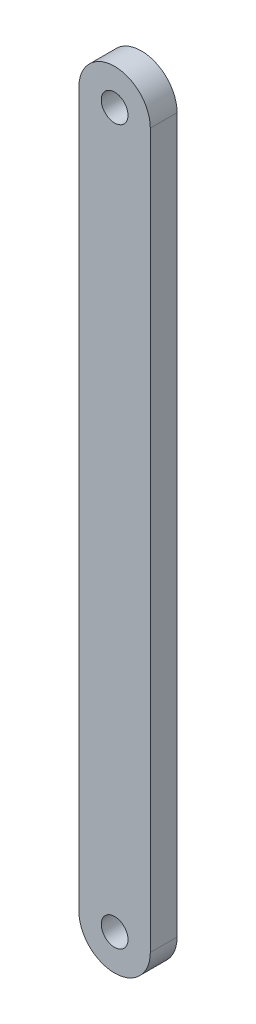
ISO-10303-21;
HEADER;
FILE_DESCRIPTION(('STEP AP214'),'2;1');
FILE_NAME('part.step','',(''),(''),'','','');
FILE_SCHEMA(('AUTOMOTIVE_DESIGN { 1 0 10303 214 1 1 1 1 }'));
ENDSEC;
DATA;
#1=APPLICATION_CONTEXT('core data for automotive mechanical design processes');
#2=APPLICATION_PROTOCOL_DEFINITION('international standard','automotive_design',2000,#1);
#3=PRODUCT_CONTEXT('',#1,'mechanical');
#4=PRODUCT('Part','Part','',(#3));
#5=PRODUCT_RELATED_PRODUCT_CATEGORY('part','',(#4));
#6=PRODUCT_DEFINITION_FORMATION('','',#4);
#7=PRODUCT_DEFINITION_CONTEXT('part definition',#1,'design');
#8=PRODUCT_DEFINITION('design','',#6,#7);
#9=PRODUCT_DEFINITION_SHAPE('','',#8);
#10=(LENGTH_UNIT() NAMED_UNIT(*) SI_UNIT(.MILLI.,.METRE.));
#11=(NAMED_UNIT(*) PLANE_ANGLE_UNIT() SI_UNIT($,.RADIAN.));
#12=(NAMED_UNIT(*) SI_UNIT($,.STERADIAN.) SOLID_ANGLE_UNIT());
#13=UNCERTAINTY_MEASURE_WITH_UNIT(LENGTH_MEASURE(1.E-05),#10,'distance_accuracy_value','');
#14=(GEOMETRIC_REPRESENTATION_CONTEXT(3) GLOBAL_UNCERTAINTY_ASSIGNED_CONTEXT((#13)) GLOBAL_UNIT_ASSIGNED_CONTEXT((#10,
#11,#12)) REPRESENTATION_CONTEXT('',''));
#15=CARTESIAN_POINT('',(0.,0.,0.));
#16=DIRECTION('',(0.,0.,1.));
#17=DIRECTION('',(1.,0.,0.));
#18=AXIS2_PLACEMENT_3D('',#15,#16,#17);
#19=CARTESIAN_POINT('',(2202.74014545455,1497.10008840878,3.));
#20=DIRECTION('',(0.,0.,1.));
#21=DIRECTION('',(1.,0.,0.));
#22=AXIS2_PLACEMENT_3D('',#19,#20,#21);
#23=PLANE('',#22);
#24=CARTESIAN_POINT('',(2202.74014545455,1577.10008840878,3.));
#25=DIRECTION('',(0.,0.,1.));
#26=DIRECTION('',(1.,0.,0.));
#27=AXIS2_PLACEMENT_3D('',#24,#25,#26);
#28=CIRCLE('',#27,1.50000000000011);
#29=CARTESIAN_POINT('',(2204.24014545455,1577.10008840878,3.));
#30=VERTEX_POINT('',#29);
#31=EDGE_CURVE('E104',#30,#30,#28,.T.);
#32=ORIENTED_EDGE('',*,*,#31,.F.);
#33=EDGE_LOOP('',(#32));
#34=FACE_BOUND('',#33,.T.);
#35=DIRECTION('',(0.,-1.,0.));
#36=VECTOR('',#35,1.);
#37=CARTESIAN_POINT('',(2198.74014545616,1571.08621907019,3.));
#38=LINE('',#37,#36);
#39=CARTESIAN_POINT('',(2198.74014545455,1577.10008841039,3.));
#40=VERTEX_POINT('',#39);
#41=CARTESIAN_POINT('',(2198.74014545455,1497.10008841174,3.));
#42=VERTEX_POINT('',#41);
#43=EDGE_CURVE('E55',#40,#42,#38,.T.);
#44=ORIENTED_EDGE('',*,*,#43,.T.);
#45=CARTESIAN_POINT('',(2202.74014545455,1497.10008840878,3.));
#46=DIRECTION('',(0.,0.,1.));
#47=DIRECTION('',(1.,0.,0.));
#48=AXIS2_PLACEMENT_3D('',#45,#46,#47);
#49=CIRCLE('',#48,4.);
#50=CARTESIAN_POINT('',(2206.74014545455,1497.1000884129,3.));
#51=VERTEX_POINT('',#50);
#52=EDGE_CURVE('E85',#42,#51,#49,.T.);
#53=ORIENTED_EDGE('',*,*,#52,.T.);
#54=DIRECTION('',(8.46933083893585E-11,1.,0.));
#55=VECTOR('',#54,1.);
#56=CARTESIAN_POINT('',(2206.74014545455,1497.1000884129,3.));
#57=LINE('',#56,#55);
#58=CARTESIAN_POINT('',(2206.74014545455,1577.10008840977,3.));
#59=VERTEX_POINT('',#58);
#60=EDGE_CURVE('E89',#51,#59,#57,.T.);
#61=ORIENTED_EDGE('',*,*,#60,.T.);
#62=CARTESIAN_POINT('',(2202.74014545455,1577.10008840878,3.));
#63=DIRECTION('',(0.,0.,1.));
#64=DIRECTION('',(1.,0.,0.));
#65=AXIS2_PLACEMENT_3D('',#62,#63,#64);
#66=CIRCLE('',#65,4.);
#67=EDGE_CURVE('E97',#59,#40,#66,.T.);
#68=ORIENTED_EDGE('',*,*,#67,.T.);
#69=EDGE_LOOP('',(#44,#53,#61,#68));
#70=FACE_BOUND('',#69,.T.);
#71=CARTESIAN_POINT('',(2202.74014545455,1497.10008840878,3.));
#72=DIRECTION('',(0.,0.,1.));
#73=DIRECTION('',(1.,0.,0.));
#74=AXIS2_PLACEMENT_3D('',#71,#72,#73);
#75=CIRCLE('',#74,1.50000000000011);
#76=CARTESIAN_POINT('',(2204.24014545455,1497.10008840878,3.));
#77=VERTEX_POINT('',#76);
#78=EDGE_CURVE('E125',#77,#77,#75,.T.);
#79=ORIENTED_EDGE('',*,*,#78,.F.);
#80=EDGE_LOOP('',(#79));
#81=FACE_BOUND('',#80,.T.);
#82=ADVANCED_FACE('F38',(#34,#70,#81),#23,.T.);
#83=CARTESIAN_POINT('',(2202.74014545455,1497.10008840878,0.));
#84=DIRECTION('',(0.,0.,1.));
#85=DIRECTION('',(1.,0.,0.));
#86=AXIS2_PLACEMENT_3D('',#83,#84,#85);
#87=PLANE('',#86);
#88=CARTESIAN_POINT('',(2202.74014545455,1497.10008840878,0.));
#89=DIRECTION('',(0.,0.,1.));
#90=DIRECTION('',(1.,0.,0.));
#91=AXIS2_PLACEMENT_3D('',#88,#89,#90);
#92=CIRCLE('',#91,4.);
#93=CARTESIAN_POINT('',(2198.74014545455,1497.10008841174,0.));
#94=VERTEX_POINT('',#93);
#95=CARTESIAN_POINT('',(2206.74014545455,1497.1000884129,0.));
#96=VERTEX_POINT('',#95);
#97=EDGE_CURVE('E93',#94,#96,#92,.T.);
#98=ORIENTED_EDGE('',*,*,#97,.F.);
#99=DIRECTION('',(0.,-1.,0.));
#100=VECTOR('',#99,1.);
#101=CARTESIAN_POINT('',(2198.74014545616,1571.08621907019,0.));
#102=LINE('',#101,#100);
#103=CARTESIAN_POINT('',(2198.74014545455,1577.10008841039,0.));
#104=VERTEX_POINT('',#103);
#105=EDGE_CURVE('E79',#104,#94,#102,.T.);
#106=ORIENTED_EDGE('',*,*,#105,.F.);
#107=CARTESIAN_POINT('',(2202.74014545455,1577.10008840878,0.));
#108=DIRECTION('',(0.,0.,1.));
#109=DIRECTION('',(1.,0.,0.));
#110=AXIS2_PLACEMENT_3D('',#107,#108,#109);
#111=CIRCLE('',#110,4.);
#112=CARTESIAN_POINT('',(2206.74014545455,1577.10008840977,0.));
#113=VERTEX_POINT('',#112);
#114=EDGE_CURVE('E106',#113,#104,#111,.T.);
#115=ORIENTED_EDGE('',*,*,#114,.F.);
#116=DIRECTION('',(-1.30512107426239E-10,1.,0.));
#117=VECTOR('',#116,1.);
#118=CARTESIAN_POINT('',(2206.74014545616,1564.74160273374,0.));
#119=LINE('',#118,#117);
#120=EDGE_CURVE('E72',#96,#113,#119,.T.);
#121=ORIENTED_EDGE('',*,*,#120,.F.);
#122=EDGE_LOOP('',(#98,#106,#115,#121));
#123=FACE_BOUND('',#122,.T.);
#124=CARTESIAN_POINT('',(2202.74014545455,1577.10008840878,0.));
#125=DIRECTION('',(0.,0.,1.));
#126=DIRECTION('',(1.,0.,0.));
#127=AXIS2_PLACEMENT_3D('',#124,#125,#126);
#128=CIRCLE('',#127,1.50000000000011);
#129=CARTESIAN_POINT('',(2204.24014545455,1577.10008840878,0.));
#130=VERTEX_POINT('',#129);
#131=EDGE_CURVE('E120',#130,#130,#128,.T.);
#132=ORIENTED_EDGE('',*,*,#131,.T.);
#133=EDGE_LOOP('',(#132));
#134=FACE_BOUND('',#133,.T.);
#135=CARTESIAN_POINT('',(2202.74014545455,1497.10008840878,0.));
#136=DIRECTION('',(0.,0.,1.));
#137=DIRECTION('',(1.,0.,0.));
#138=AXIS2_PLACEMENT_3D('',#135,#136,#137);
#139=CIRCLE('',#138,1.50000000000011);
#140=CARTESIAN_POINT('',(2204.24014545455,1497.10008840878,0.));
#141=VERTEX_POINT('',#140);
#142=EDGE_CURVE('E123',#141,#141,#139,.T.);
#143=ORIENTED_EDGE('',*,*,#142,.T.);
#144=EDGE_LOOP('',(#143));
#145=FACE_BOUND('',#144,.T.);
#146=ADVANCED_FACE('F113',(#123,#134,#145),#87,.F.);
#147=CARTESIAN_POINT('',(2202.74014545455,1497.10008840878,3.));
#148=DIRECTION('',(0.,0.,-1.));
#149=DIRECTION('',(-1.,0.,0.));
#150=AXIS2_PLACEMENT_3D('',#147,#148,#149);
#151=CYLINDRICAL_SURFACE('',#150,4.);
#152=ORIENTED_EDGE('',*,*,#97,.T.);
#153=DIRECTION('',(0.,0.,-1.));
#154=VECTOR('',#153,1.);
#155=CARTESIAN_POINT('',(2206.74014545455,1497.1000884129,3.));
#156=LINE('',#155,#154);
#157=EDGE_CURVE('E47',#51,#96,#156,.T.);
#158=ORIENTED_EDGE('',*,*,#157,.F.);
#159=ORIENTED_EDGE('',*,*,#52,.F.);
#160=DIRECTION('',(0.,0.,-1.));
#161=VECTOR('',#160,1.);
#162=CARTESIAN_POINT('',(2198.74014545455,1497.10008841174,3.));
#163=LINE('',#162,#161);
#164=EDGE_CURVE('E11',#42,#94,#163,.T.);
#165=ORIENTED_EDGE('',*,*,#164,.T.);
#166=EDGE_LOOP('',(#152,#158,#159,#165));
#167=FACE_BOUND('',#166,.T.);
#168=ADVANCED_FACE('F40',(#167),#151,.T.);
#169=CARTESIAN_POINT('',(2206.74014545616,1564.74160273374,3.));
#170=DIRECTION('',(-1.,-1.30512107426239E-10,0.));
#171=DIRECTION('',(1.30512107426239E-10,-1.,0.));
#172=AXIS2_PLACEMENT_3D('',#169,#170,#171);
#173=PLANE('',#172);
#174=ORIENTED_EDGE('',*,*,#120,.T.);
#175=DIRECTION('',(0.,0.,-1.));
#176=VECTOR('',#175,1.);
#177=CARTESIAN_POINT('',(2206.74014545455,1577.10008840977,3.));
#178=LINE('',#177,#176);
#179=EDGE_CURVE('E94',#59,#113,#178,.T.);
#180=ORIENTED_EDGE('',*,*,#179,.F.);
#181=ORIENTED_EDGE('',*,*,#60,.F.);
#182=ORIENTED_EDGE('',*,*,#157,.T.);
#183=EDGE_LOOP('',(#174,#180,#181,#182));
#184=FACE_BOUND('',#183,.T.);
#185=ADVANCED_FACE('F95',(#184),#173,.F.);
#186=CARTESIAN_POINT('',(2202.74014545455,1577.10008840878,3.));
#187=DIRECTION('',(0.,0.,-1.));
#188=DIRECTION('',(-1.,0.,0.));
#189=AXIS2_PLACEMENT_3D('',#186,#187,#188);
#190=CYLINDRICAL_SURFACE('',#189,4.);
#191=ORIENTED_EDGE('',*,*,#114,.T.);
#192=DIRECTION('',(0.,0.,-1.));
#193=VECTOR('',#192,1.);
#194=CARTESIAN_POINT('',(2198.74014545455,1577.10008841039,3.));
#195=LINE('',#194,#193);
#196=EDGE_CURVE('E99',#40,#104,#195,.T.);
#197=ORIENTED_EDGE('',*,*,#196,.F.);
#198=ORIENTED_EDGE('',*,*,#67,.F.);
#199=ORIENTED_EDGE('',*,*,#179,.T.);
#200=EDGE_LOOP('',(#191,#197,#198,#199));
#201=FACE_BOUND('',#200,.T.);
#202=ADVANCED_FACE('F111',(#201),#190,.T.);
#203=CARTESIAN_POINT('',(2198.74014545616,1571.08621907019,3.));
#204=DIRECTION('',(1.,0.,0.));
#205=DIRECTION('',(0.,0.,-1.));
#206=AXIS2_PLACEMENT_3D('',#203,#204,#205);
#207=PLANE('',#206);
#208=ORIENTED_EDGE('',*,*,#105,.T.);
#209=ORIENTED_EDGE('',*,*,#164,.F.);
#210=ORIENTED_EDGE('',*,*,#43,.F.);
#211=ORIENTED_EDGE('',*,*,#196,.T.);
#212=EDGE_LOOP('',(#208,#209,#210,#211));
#213=FACE_BOUND('',#212,.T.);
#214=ADVANCED_FACE('F144',(#213),#207,.F.);
#215=CARTESIAN_POINT('',(2202.74014545455,1577.10008840878,3.));
#216=DIRECTION('',(0.,0.,-1.));
#217=DIRECTION('',(-1.,0.,0.));
#218=AXIS2_PLACEMENT_3D('',#215,#216,#217);
#219=CYLINDRICAL_SURFACE('',#218,1.50000000000011);
#220=ORIENTED_EDGE('',*,*,#31,.T.);
#221=EDGE_LOOP('',(#220));
#222=FACE_BOUND('',#221,.T.);
#223=ORIENTED_EDGE('',*,*,#131,.F.);
#224=EDGE_LOOP('',(#223));
#225=FACE_BOUND('',#224,.T.);
#226=ADVANCED_FACE('F134',(#222,#225),#219,.F.);
#227=CARTESIAN_POINT('',(2202.74014545455,1497.10008840878,3.));
#228=DIRECTION('',(0.,0.,-1.));
#229=DIRECTION('',(-1.,0.,0.));
#230=AXIS2_PLACEMENT_3D('',#227,#228,#229);
#231=CYLINDRICAL_SURFACE('',#230,1.50000000000011);
#232=ORIENTED_EDGE('',*,*,#78,.T.);
#233=EDGE_LOOP('',(#232));
#234=FACE_BOUND('',#233,.T.);
#235=ORIENTED_EDGE('',*,*,#142,.F.);
#236=EDGE_LOOP('',(#235));
#237=FACE_BOUND('',#236,.T.);
#238=ADVANCED_FACE('F224',(#234,#237),#231,.F.);
#239=CLOSED_SHELL('',(#82,#146,#168,#185,#202,#214,#226,#238));
#240=MANIFOLD_SOLID_BREP('B2',#239);
#241=ADVANCED_BREP_SHAPE_REPRESENTATION('',(#18,#240),#14);
#242=SHAPE_DEFINITION_REPRESENTATION(#9,#241);
ENDSEC;
END-ISO-10303-21;
